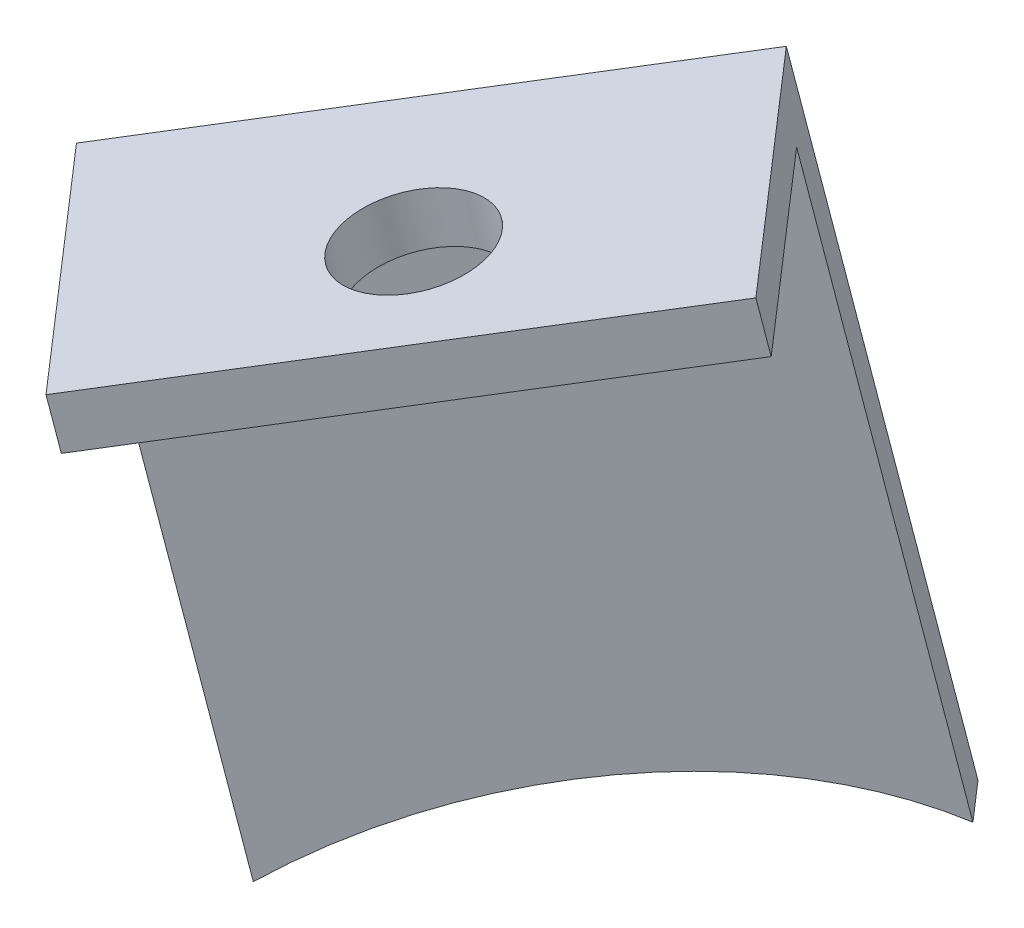
ISO-10303-21;
HEADER;
FILE_DESCRIPTION(('STEP AP214'),'2;1');
FILE_NAME('part.step','',(''),(''),'','','');
FILE_SCHEMA(('AUTOMOTIVE_DESIGN { 1 0 10303 214 1 1 1 1 }'));
ENDSEC;
DATA;
#1=APPLICATION_CONTEXT('core data for automotive mechanical design processes');
#2=APPLICATION_PROTOCOL_DEFINITION('international standard','automotive_design',2000,#1);
#3=PRODUCT_CONTEXT('',#1,'mechanical');
#4=PRODUCT('Part','Part','',(#3));
#5=PRODUCT_RELATED_PRODUCT_CATEGORY('part','',(#4));
#6=PRODUCT_DEFINITION_FORMATION('','',#4);
#7=PRODUCT_DEFINITION_CONTEXT('part definition',#1,'design');
#8=PRODUCT_DEFINITION('design','',#6,#7);
#9=PRODUCT_DEFINITION_SHAPE('','',#8);
#10=(LENGTH_UNIT() NAMED_UNIT(*) SI_UNIT(.MILLI.,.METRE.));
#11=(NAMED_UNIT(*) PLANE_ANGLE_UNIT() SI_UNIT($,.RADIAN.));
#12=(NAMED_UNIT(*) SI_UNIT($,.STERADIAN.) SOLID_ANGLE_UNIT());
#13=UNCERTAINTY_MEASURE_WITH_UNIT(LENGTH_MEASURE(1.E-05),#10,'distance_accuracy_value','');
#14=(GEOMETRIC_REPRESENTATION_CONTEXT(3) GLOBAL_UNCERTAINTY_ASSIGNED_CONTEXT((#13)) GLOBAL_UNIT_ASSIGNED_CONTEXT((#10,
#11,#12)) REPRESENTATION_CONTEXT('',''));
#15=CARTESIAN_POINT('',(0.,0.,0.));
#16=DIRECTION('',(0.,0.,1.));
#17=DIRECTION('',(1.,0.,0.));
#18=AXIS2_PLACEMENT_3D('',#15,#16,#17);
#19=CARTESIAN_POINT('',(909.399199225308,-359.189028773466,-416.160760837431));
#20=DIRECTION('',(0.656059028990508,0.,0.754709580222772));
#21=DIRECTION('',(-0.754709580222772,0.,0.656059028990508));
#22=AXIS2_PLACEMENT_3D('',#19,#20,#21);
#23=PLANE('',#22);
#24=DIRECTION('',(-0.159336639189074,0.97745947709662,0.138509227295271));
#25=VECTOR('',#24,1.);
#26=CARTESIAN_POINT('',(914.320802830597,-343.23861305799,-420.439045580297));
#27=LINE('',#26,#25);
#28=CARTESIAN_POINT('',(914.320802830597,-343.23861305799,-420.439045580297));
#29=VERTEX_POINT('',#28);
#30=CARTESIAN_POINT('',(910.858746443077,-322.000435552509,-417.429525877054));
#31=VERTEX_POINT('',#30);
#32=EDGE_CURVE('E148',#29,#31,#27,.T.);
#33=ORIENTED_EDGE('',*,*,#32,.F.);
#34=CARTESIAN_POINT('',(933.22503689066,-345.357596421036,-436.872245537284));
#35=CARTESIAN_POINT('',(925.653414901661,-322.458928477497,-430.290334958489));
#36=CARTESIAN_POINT('',(901.827577236309,-336.290360829927,-409.578850258637));
#37=CARTESIAN_POINT('',(909.399199225308,-359.189028773466,-416.160760837431));
#38=CARTESIAN_POINT('',(916.970821214307,-382.087696717005,-422.742671416226));
#39=CARTESIAN_POINT('',(940.796658879659,-368.256264364575,-443.454156116079));
#40=CARTESIAN_POINT('',(933.22503689066,-345.357596421036,-436.872245537284));
#41=(BOUNDED_CURVE() B_SPLINE_CURVE(3,(#34,#35,#36,#37,#38,#39,#40),.UNSPECIFIED.,.T.,
.F.) B_SPLINE_CURVE_WITH_KNOTS((4,3,4),(0.,0.5,1.),
.UNSPECIFIED.) CURVE() GEOMETRIC_REPRESENTATION_ITEM() RATIONAL_B_SPLINE_CURVE((1.,
0.333333333333333,0.333333333333333,1.,0.333333333333333,0.333333333333333,1.)) REPRESENTATION_ITEM(''));
#42=CARTESIAN_POINT('',(929.277449777312,-340.25954118089,-433.440660413277));
#43=VERTEX_POINT('',#42);
#44=EDGE_CURVE('E90',#43,#29,#41,.T.);
#45=ORIENTED_EDGE('',*,*,#44,.F.);
#46=DIRECTION('',(0.159336639189074,-0.97745947709662,-0.138509227295272));
#47=VECTOR('',#46,1.);
#48=CARTESIAN_POINT('',(929.277449777312,-340.25954118089,-433.440660413277));
#49=LINE('',#48,#47);
#50=CARTESIAN_POINT('',(925.612707075965,-317.777973207667,-430.254948185486));
#51=VERTEX_POINT('',#50);
#52=EDGE_CURVE('E95',#51,#43,#49,.T.);
#53=ORIENTED_EDGE('',*,*,#52,.F.);
#54=DIRECTION('',(-0.73769803164436,-0.211123117242059,0.641271115421576));
#55=VECTOR('',#54,1.);
#56=CARTESIAN_POINT('',(925.612707075965,-317.777973207667,-430.254948185486));
#57=LINE('',#56,#55);
#58=EDGE_CURVE('E140',#51,#31,#57,.T.);
#59=ORIENTED_EDGE('',*,*,#58,.T.);
#60=EDGE_LOOP('',(#33,#45,#53,#59));
#61=FACE_BOUND('',#60,.T.);
#62=ADVANCED_FACE('F37',(#61),#23,.T.);
#63=DIRECTION('',(-0.656059028990508,0.,-0.754709580222771));
#64=VECTOR('',#63,1.);
#65=SURFACE_OF_LINEAR_EXTRUSION('',#41,#64);
#66=CARTESIAN_POINT('',(931.912918832679,-345.357596421036,-438.38166469773));
#67=CARTESIAN_POINT('',(924.341296843679,-322.458928477497,-431.799754118935));
#68=CARTESIAN_POINT('',(900.515459178327,-336.290360829927,-411.088269419082));
#69=CARTESIAN_POINT('',(908.087081167327,-359.189028773466,-417.670179997877));
#70=CARTESIAN_POINT('',(915.658703156326,-382.087696717005,-424.252090576672));
#71=CARTESIAN_POINT('',(939.484540821678,-368.256264364575,-444.963575276524));
#72=CARTESIAN_POINT('',(931.912918832679,-345.357596421036,-438.38166469773));
#73=(BOUNDED_CURVE() B_SPLINE_CURVE(3,(#66,#67,#68,#69,#70,#71,#72),.UNSPECIFIED.,.T.,
.F.) B_SPLINE_CURVE_WITH_KNOTS((4,3,4),(0.,0.5,1.),
.UNSPECIFIED.) CURVE() GEOMETRIC_REPRESENTATION_ITEM() RATIONAL_B_SPLINE_CURVE((1.,
0.333333333333333,0.333333333333333,1.,0.333333333333333,0.333333333333333,1.)) REPRESENTATION_ITEM(''));
#74=CARTESIAN_POINT('',(927.965331719331,-340.25954118089,-434.950079573723));
#75=VERTEX_POINT('',#74);
#76=CARTESIAN_POINT('',(913.008684772616,-343.23861305799,-421.948464740743));
#77=VERTEX_POINT('',#76);
#78=EDGE_CURVE('E85',#75,#77,#73,.T.);
#79=ORIENTED_EDGE('',*,*,#78,.F.);
#80=DIRECTION('',(-0.656059028990508,0.,-0.754709580222771));
#81=VECTOR('',#80,1.);
#82=CARTESIAN_POINT('',(929.277449777312,-340.25954118089,-433.440660413277));
#83=LINE('',#82,#81);
#84=EDGE_CURVE('E62',#43,#75,#83,.T.);
#85=ORIENTED_EDGE('',*,*,#84,.F.);
#86=ORIENTED_EDGE('',*,*,#44,.T.);
#87=DIRECTION('',(-0.656059028990508,0.,-0.754709580222771));
#88=VECTOR('',#87,1.);
#89=CARTESIAN_POINT('',(914.320802830597,-343.23861305799,-420.439045580297));
#90=LINE('',#89,#88);
#91=EDGE_CURVE('E11',#29,#77,#90,.T.);
#92=ORIENTED_EDGE('',*,*,#91,.T.);
#93=EDGE_LOOP('',(#79,#85,#86,#92));
#94=FACE_BOUND('',#93,.T.);
#95=ADVANCED_FACE('F39',(#94),#65,.T.);
#96=CARTESIAN_POINT('',(914.320802830597,-343.23861305799,-420.439045580297));
#97=DIRECTION('',(0.737698031644359,0.211123117242054,-0.641271115421579));
#98=DIRECTION('',(0.656059028990508,0.,0.754709580222771));
#99=AXIS2_PLACEMENT_3D('',#96,#97,#98);
#100=PLANE('',#99);
#101=DIRECTION('',(-0.159336639189074,0.97745947709662,0.138509227295271));
#102=VECTOR('',#101,1.);
#103=CARTESIAN_POINT('',(913.008684772616,-343.23861305799,-421.948464740743));
#104=LINE('',#103,#102);
#105=CARTESIAN_POINT('',(909.227955106717,-320.045516598315,-418.661926582909));
#106=VERTEX_POINT('',#105);
#107=EDGE_CURVE('E99',#77,#106,#104,.T.);
#108=ORIENTED_EDGE('',*,*,#107,.F.);
#109=ORIENTED_EDGE('',*,*,#91,.F.);
#110=ORIENTED_EDGE('',*,*,#32,.T.);
#111=DIRECTION('',(-0.656059028990508,0.,-0.754709580222772));
#112=VECTOR('',#111,1.);
#113=CARTESIAN_POINT('',(917.419336732983,-322.000435552509,-409.882430074827));
#114=LINE('',#113,#112);
#115=CARTESIAN_POINT('',(917.419336732983,-322.000435552509,-409.882430074827));
#116=VERTEX_POINT('',#115);
#117=EDGE_CURVE('E53',#116,#31,#114,.T.);
#118=ORIENTED_EDGE('',*,*,#117,.F.);
#119=DIRECTION('',(0.159336639189084,-0.977459477096616,-0.138509227295289));
#120=VECTOR('',#119,1.);
#121=CARTESIAN_POINT('',(917.100663454605,-320.045516598315,-409.605411620236));
#122=LINE('',#121,#120);
#123=CARTESIAN_POINT('',(917.100663454605,-320.045516598315,-409.605411620236));
#124=VERTEX_POINT('',#123);
#125=EDGE_CURVE('E120',#124,#116,#122,.T.);
#126=ORIENTED_EDGE('',*,*,#125,.F.);
#127=DIRECTION('',(-0.656059028990508,0.,-0.754709580222771));
#128=VECTOR('',#127,1.);
#129=CARTESIAN_POINT('',(910.540073164698,-320.045516598315,-417.152507422464));
#130=LINE('',#129,#128);
#131=EDGE_CURVE('E46',#124,#106,#130,.T.);
#132=ORIENTED_EDGE('',*,*,#131,.T.);
#133=EDGE_LOOP('',(#108,#109,#110,#118,#126,#132));
#134=FACE_BOUND('',#133,.T.);
#135=ADVANCED_FACE('F117',(#134),#100,.F.);
#136=CARTESIAN_POINT('',(925.294033797586,-315.823054253474,-429.977929730895));
#137=DIRECTION('',(0.159336639189076,-0.977459477096619,-0.138509227295273));
#138=DIRECTION('',(0.986972766259254,0.160887409894487,0.));
#139=AXIS2_PLACEMENT_3D('',#136,#137,#138);
#140=PLANE('',#139);
#141=CARTESIAN_POINT('',(921.197348626095,-317.934285425895,-419.791670675566));
#142=DIRECTION('',(-0.159336639189076,0.977459477096619,0.138509227295273));
#143=DIRECTION('',(0.986972766259254,0.160887409894487,0.));
#144=AXIS2_PLACEMENT_3D('',#141,#142,#143);
#145=CIRCLE('',#144,2.49999999999987);
#146=CARTESIAN_POINT('',(923.664780541743,-317.532066901158,-419.791670675566));
#147=VERTEX_POINT('',#146);
#148=EDGE_CURVE('E146',#147,#147,#145,.T.);
#149=ORIENTED_EDGE('',*,*,#148,.F.);
#150=EDGE_LOOP('',(#149));
#151=FACE_BOUND('',#150,.T.);
#152=DIRECTION('',(0.737698031644359,0.211123117242057,-0.641271115421578));
#153=VECTOR('',#152,1.);
#154=CARTESIAN_POINT('',(923.981915739605,-315.823054253474,-431.487348891341));
#155=LINE('',#154,#153);
#156=CARTESIAN_POINT('',(923.981915739605,-315.823054253474,-431.487348891341));
#157=VERTEX_POINT('',#156);
#158=EDGE_CURVE('E86',#106,#157,#155,.T.);
#159=ORIENTED_EDGE('',*,*,#158,.F.);
#160=ORIENTED_EDGE('',*,*,#131,.F.);
#161=DIRECTION('',(-0.737698031644364,-0.211123117242059,0.641271115421572));
#162=VECTOR('',#161,1.);
#163=CARTESIAN_POINT('',(931.854624087492,-315.823054253474,-422.430833928667));
#164=LINE('',#163,#162);
#165=CARTESIAN_POINT('',(931.854624087492,-315.823054253474,-422.430833928667));
#166=VERTEX_POINT('',#165);
#167=EDGE_CURVE('E126',#166,#124,#164,.T.);
#168=ORIENTED_EDGE('',*,*,#167,.F.);
#169=DIRECTION('',(-0.656059028990508,0.,-0.754709580222771));
#170=VECTOR('',#169,1.);
#171=CARTESIAN_POINT('',(925.294033797586,-315.823054253474,-429.977929730895));
#172=LINE('',#171,#170);
#173=EDGE_CURVE('E97',#166,#157,#172,.T.);
#174=ORIENTED_EDGE('',*,*,#173,.T.);
#175=EDGE_LOOP('',(#159,#160,#168,#174));
#176=FACE_BOUND('',#175,.T.);
#177=ADVANCED_FACE('F123',(#151,#176),#140,.F.);
#178=CARTESIAN_POINT('',(929.277449777312,-340.25954118089,-433.440660413277));
#179=DIRECTION('',(-0.737698031644359,-0.211123117242055,0.641271115421579));
#180=DIRECTION('',(-0.656059028990508,0.,-0.754709580222771));
#181=AXIS2_PLACEMENT_3D('',#178,#179,#180);
#182=PLANE('',#181);
#183=DIRECTION('',(0.159336639189074,-0.97745947709662,-0.138509227295272));
#184=VECTOR('',#183,1.);
#185=CARTESIAN_POINT('',(927.965331719331,-340.25954118089,-434.950079573723));
#186=LINE('',#185,#184);
#187=EDGE_CURVE('E82',#157,#75,#186,.T.);
#188=ORIENTED_EDGE('',*,*,#187,.F.);
#189=ORIENTED_EDGE('',*,*,#173,.F.);
#190=DIRECTION('',(-0.159336639189088,0.977459477096615,0.138509227295293));
#191=VECTOR('',#190,1.);
#192=CARTESIAN_POINT('',(932.17329736587,-317.777973207667,-422.707852383258));
#193=LINE('',#192,#191);
#194=CARTESIAN_POINT('',(932.17329736587,-317.777973207667,-422.707852383258));
#195=VERTEX_POINT('',#194);
#196=EDGE_CURVE('E138',#195,#166,#193,.T.);
#197=ORIENTED_EDGE('',*,*,#196,.F.);
#198=DIRECTION('',(-0.656059028990508,0.,-0.754709580222772));
#199=VECTOR('',#198,1.);
#200=CARTESIAN_POINT('',(932.17329736587,-317.777973207667,-422.707852383258));
#201=LINE('',#200,#199);
#202=EDGE_CURVE('E102',#195,#51,#201,.T.);
#203=ORIENTED_EDGE('',*,*,#202,.T.);
#204=ORIENTED_EDGE('',*,*,#52,.T.);
#205=ORIENTED_EDGE('',*,*,#84,.T.);
#206=EDGE_LOOP('',(#188,#189,#197,#203,#204,#205));
#207=FACE_BOUND('',#206,.T.);
#208=ADVANCED_FACE('F92',(#207),#182,.F.);
#209=CARTESIAN_POINT('',(908.087081167327,-359.189028773466,-417.670179997877));
#210=DIRECTION('',(0.656059028990508,0.,0.754709580222772));
#211=DIRECTION('',(-0.754709580222772,0.,0.656059028990508));
#212=AXIS2_PLACEMENT_3D('',#209,#210,#211);
#213=PLANE('',#212);
#214=ORIENTED_EDGE('',*,*,#78,.T.);
#215=ORIENTED_EDGE('',*,*,#107,.T.);
#216=ORIENTED_EDGE('',*,*,#158,.T.);
#217=ORIENTED_EDGE('',*,*,#187,.T.);
#218=EDGE_LOOP('',(#214,#215,#216,#217));
#219=FACE_BOUND('',#218,.T.);
#220=ADVANCED_FACE('F83',(#219),#213,.F.);
#221=CARTESIAN_POINT('',(932.17329736587,-317.777973207667,-422.707852383258));
#222=DIRECTION('',(-0.159336639189073,0.977459477096619,0.13850922729528));
#223=DIRECTION('',(-0.986972766259254,-0.160887409894484,0.));
#224=AXIS2_PLACEMENT_3D('',#221,#222,#223);
#225=PLANE('',#224);
#226=CARTESIAN_POINT('',(921.516021904474,-319.889204380088,-420.068689130156));
#227=DIRECTION('',(-0.159336639189073,0.977459477096619,0.138509227295279));
#228=DIRECTION('',(0.986972766259254,0.160887409894484,0.));
#229=AXIS2_PLACEMENT_3D('',#226,#227,#228);
#230=CIRCLE('',#229,2.49999999999987);
#231=CARTESIAN_POINT('',(923.983453820122,-319.486985855352,-420.068689130156));
#232=VERTEX_POINT('',#231);
#233=EDGE_CURVE('E162',#232,#232,#230,.T.);
#234=ORIENTED_EDGE('',*,*,#233,.T.);
#235=EDGE_LOOP('',(#234));
#236=FACE_BOUND('',#235,.T.);
#237=ORIENTED_EDGE('',*,*,#58,.F.);
#238=ORIENTED_EDGE('',*,*,#202,.F.);
#239=DIRECTION('',(-0.73769803164436,-0.211123117242059,0.641271115421576));
#240=VECTOR('',#239,1.);
#241=CARTESIAN_POINT('',(932.17329736587,-317.777973207667,-422.707852383258));
#242=LINE('',#241,#240);
#243=EDGE_CURVE('E145',#195,#116,#242,.T.);
#244=ORIENTED_EDGE('',*,*,#243,.T.);
#245=ORIENTED_EDGE('',*,*,#117,.T.);
#246=EDGE_LOOP('',(#237,#238,#244,#245));
#247=FACE_BOUND('',#246,.T.);
#248=ADVANCED_FACE('F141',(#236,#247),#225,.F.);
#249=CARTESIAN_POINT('',(191.922880158915,-2.09076071398229E-12,220.78201795768));
#250=DIRECTION('',(-0.656059028990508,0.,-0.754709580222772));
#251=DIRECTION('',(0.754709580222772,0.,-0.656059028990508));
#252=AXIS2_PLACEMENT_3D('',#249,#250,#251);
#253=PLANE('',#252);
#254=ORIENTED_EDGE('',*,*,#243,.F.);
#255=ORIENTED_EDGE('',*,*,#196,.T.);
#256=ORIENTED_EDGE('',*,*,#167,.T.);
#257=ORIENTED_EDGE('',*,*,#125,.T.);
#258=EDGE_LOOP('',(#254,#255,#256,#257));
#259=FACE_BOUND('',#258,.T.);
#260=ADVANCED_FACE('F170',(#259),#253,.F.);
#261=CARTESIAN_POINT('',(919.922655512583,-310.114609609122,-418.683596857203));
#262=DIRECTION('',(0.159336639189073,-0.977459477096619,-0.138509227295279));
#263=DIRECTION('',(0.986972766259254,0.160887409894484,0.));
#264=AXIS2_PLACEMENT_3D('',#261,#262,#263);
#265=CYLINDRICAL_SURFACE('',#264,2.49999999999987);
#266=ORIENTED_EDGE('',*,*,#233,.F.);
#267=EDGE_LOOP('',(#266));
#268=FACE_BOUND('',#267,.T.);
#269=ORIENTED_EDGE('',*,*,#148,.T.);
#270=EDGE_LOOP('',(#269));
#271=FACE_BOUND('',#270,.T.);
#272=ADVANCED_FACE('F167',(#268,#271),#265,.F.);
#273=CLOSED_SHELL('',(#62,#95,#135,#177,#208,#220,#248,#260,#272));
#274=MANIFOLD_SOLID_BREP('B2',#273);
#275=ADVANCED_BREP_SHAPE_REPRESENTATION('',(#18,#274),#14);
#276=SHAPE_DEFINITION_REPRESENTATION(#9,#275);
ENDSEC;
END-ISO-10303-21;
